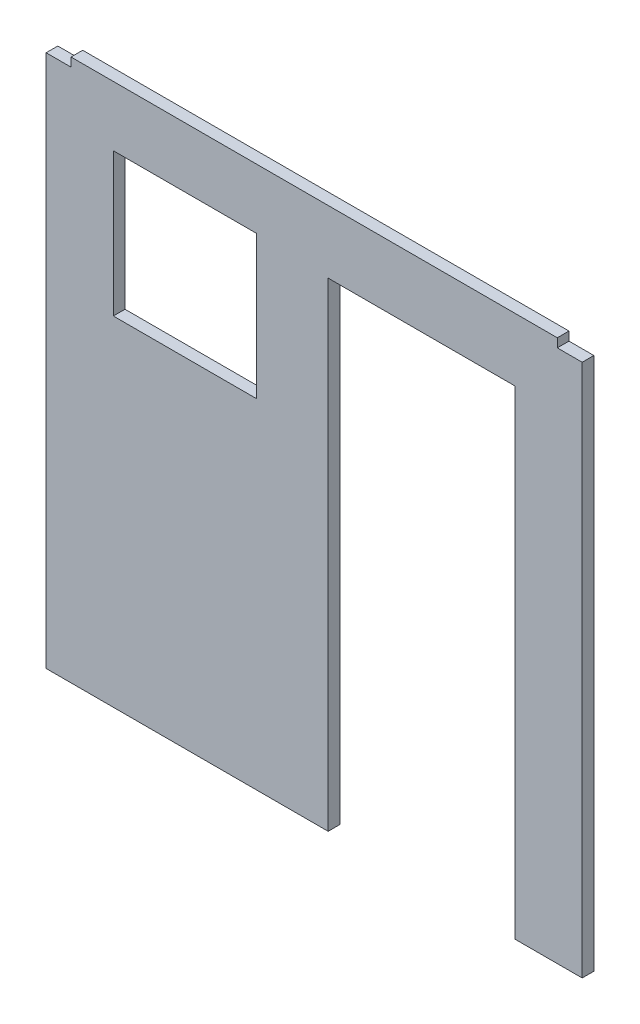
ISO-10303-21;
HEADER;
FILE_DESCRIPTION(('STEP AP214'),'2;1');
FILE_NAME('part.step','',(''),(''),'','','');
FILE_SCHEMA(('AUTOMOTIVE_DESIGN { 1 0 10303 214 1 1 1 1 }'));
ENDSEC;
DATA;
#1=APPLICATION_CONTEXT('core data for automotive mechanical design processes');
#2=APPLICATION_PROTOCOL_DEFINITION('international standard','automotive_design',2000,#1);
#3=PRODUCT_CONTEXT('',#1,'mechanical');
#4=PRODUCT('Part','Part','',(#3));
#5=PRODUCT_RELATED_PRODUCT_CATEGORY('part','',(#4));
#6=PRODUCT_DEFINITION_FORMATION('','',#4);
#7=PRODUCT_DEFINITION_CONTEXT('part definition',#1,'design');
#8=PRODUCT_DEFINITION('design','',#6,#7);
#9=PRODUCT_DEFINITION_SHAPE('','',#8);
#10=(LENGTH_UNIT() NAMED_UNIT(*) SI_UNIT(.MILLI.,.METRE.));
#11=(NAMED_UNIT(*) PLANE_ANGLE_UNIT() SI_UNIT($,.RADIAN.));
#12=(NAMED_UNIT(*) SI_UNIT($,.STERADIAN.) SOLID_ANGLE_UNIT());
#13=UNCERTAINTY_MEASURE_WITH_UNIT(LENGTH_MEASURE(1.E-05),#10,'distance_accuracy_value','');
#14=(GEOMETRIC_REPRESENTATION_CONTEXT(3) GLOBAL_UNCERTAINTY_ASSIGNED_CONTEXT((#13)) GLOBAL_UNIT_ASSIGNED_CONTEXT((#10,
#11,#12)) REPRESENTATION_CONTEXT('',''));
#15=CARTESIAN_POINT('',(0.,0.,0.));
#16=DIRECTION('',(0.,0.,1.));
#17=DIRECTION('',(1.,0.,0.));
#18=AXIS2_PLACEMENT_3D('',#15,#16,#17);
#19=CARTESIAN_POINT('',(0.,-1178.179,50.8));
#20=DIRECTION('',(0.,1.,0.));
#21=DIRECTION('',(0.,0.,1.));
#22=AXIS2_PLACEMENT_3D('',#19,#20,#21);
#23=PLANE('',#22);
#24=DIRECTION('',(1.,0.,0.));
#25=VECTOR('',#24,1.);
#26=CARTESIAN_POINT('',(0.,-1178.179,50.8));
#27=LINE('',#26,#25);
#28=CARTESIAN_POINT('',(873.633,-1178.179,50.8));
#29=VERTEX_POINT('',#28);
#30=CARTESIAN_POINT('',(1165.225,-1178.179,50.8));
#31=VERTEX_POINT('',#30);
#32=EDGE_CURVE('E222',#29,#31,#27,.T.);
#33=ORIENTED_EDGE('',*,*,#32,.F.);
#34=DIRECTION('',(0.,0.,1.));
#35=VECTOR('',#34,1.);
#36=CARTESIAN_POINT('',(873.633,-1178.179,-2235.777198202));
#37=LINE('',#36,#35);
#38=CARTESIAN_POINT('',(873.633,-1178.179,0.));
#39=VERTEX_POINT('',#38);
#40=EDGE_CURVE('E185',#39,#29,#37,.T.);
#41=ORIENTED_EDGE('',*,*,#40,.F.);
#42=DIRECTION('',(1.,0.,0.));
#43=VECTOR('',#42,1.);
#44=CARTESIAN_POINT('',(0.,-1178.179,0.));
#45=LINE('',#44,#43);
#46=CARTESIAN_POINT('',(1165.225,-1178.179,0.));
#47=VERTEX_POINT('',#46);
#48=EDGE_CURVE('E246',#39,#47,#45,.T.);
#49=ORIENTED_EDGE('',*,*,#48,.T.);
#50=DIRECTION('',(0.,0.,-1.));
#51=VECTOR('',#50,1.);
#52=CARTESIAN_POINT('',(1165.225,-1178.179,50.8));
#53=LINE('',#52,#51);
#54=EDGE_CURVE('E253',#31,#47,#53,.T.);
#55=ORIENTED_EDGE('',*,*,#54,.F.);
#56=EDGE_LOOP('',(#33,#41,#49,#55));
#57=FACE_BOUND('',#56,.T.);
#58=ADVANCED_FACE('F37',(#57),#23,.F.);
#59=CARTESIAN_POINT('',(0.,1140.079,50.8));
#60=DIRECTION('',(0.,1.,0.));
#61=DIRECTION('',(0.,0.,1.));
#62=AXIS2_PLACEMENT_3D('',#59,#60,#61);
#63=PLANE('',#62);
#64=DIRECTION('',(1.,0.,0.));
#65=VECTOR('',#64,1.);
#66=CARTESIAN_POINT('',(0.,1140.079,0.));
#67=LINE('',#66,#65);
#68=CARTESIAN_POINT('',(1057.021,1140.079,0.));
#69=VERTEX_POINT('',#68);
#70=CARTESIAN_POINT('',(1165.225,1140.079,0.));
#71=VERTEX_POINT('',#70);
#72=EDGE_CURVE('E179',#69,#71,#67,.T.);
#73=ORIENTED_EDGE('',*,*,#72,.F.);
#74=DIRECTION('',(0.,0.,-1.));
#75=VECTOR('',#74,1.);
#76=CARTESIAN_POINT('',(1057.021,1140.079,50.8));
#77=LINE('',#76,#75);
#78=CARTESIAN_POINT('',(1057.021,1140.079,50.8));
#79=VERTEX_POINT('',#78);
#80=EDGE_CURVE('E11',#79,#69,#77,.T.);
#81=ORIENTED_EDGE('',*,*,#80,.F.);
#82=DIRECTION('',(1.,0.,0.));
#83=VECTOR('',#82,1.);
#84=CARTESIAN_POINT('',(0.,1140.079,50.8));
#85=LINE('',#84,#83);
#86=CARTESIAN_POINT('',(1165.225,1140.079,50.8));
#87=VERTEX_POINT('',#86);
#88=EDGE_CURVE('E205',#79,#87,#85,.T.);
#89=ORIENTED_EDGE('',*,*,#88,.T.);
#90=DIRECTION('',(0.,0.,-1.));
#91=VECTOR('',#90,1.);
#92=CARTESIAN_POINT('',(1165.225,1140.079,50.8));
#93=LINE('',#92,#91);
#94=EDGE_CURVE('E229',#87,#71,#93,.T.);
#95=ORIENTED_EDGE('',*,*,#94,.T.);
#96=EDGE_LOOP('',(#73,#81,#89,#95));
#97=FACE_BOUND('',#96,.T.);
#98=ADVANCED_FACE('F39',(#97),#63,.T.);
#99=CARTESIAN_POINT('',(1057.021,0.,50.8));
#100=DIRECTION('',(1.,0.,0.));
#101=DIRECTION('',(0.,0.,-1.));
#102=AXIS2_PLACEMENT_3D('',#99,#100,#101);
#103=PLANE('',#102);
#104=DIRECTION('',(0.,-1.,0.));
#105=VECTOR('',#104,1.);
#106=CARTESIAN_POINT('',(1057.021,0.,0.));
#107=LINE('',#106,#105);
#108=CARTESIAN_POINT('',(1057.021,1178.179,0.));
#109=VERTEX_POINT('',#108);
#110=EDGE_CURVE('E232',#109,#69,#107,.T.);
#111=ORIENTED_EDGE('',*,*,#110,.F.);
#112=DIRECTION('',(0.,0.,-1.));
#113=VECTOR('',#112,1.);
#114=CARTESIAN_POINT('',(1057.021,1178.179,50.8));
#115=LINE('',#114,#113);
#116=CARTESIAN_POINT('',(1057.021,1178.179,50.8));
#117=VERTEX_POINT('',#116);
#118=EDGE_CURVE('E45',#117,#109,#115,.T.);
#119=ORIENTED_EDGE('',*,*,#118,.F.);
#120=DIRECTION('',(0.,-1.,0.));
#121=VECTOR('',#120,1.);
#122=CARTESIAN_POINT('',(1057.021,0.,50.8));
#123=LINE('',#122,#121);
#124=EDGE_CURVE('E208',#117,#79,#123,.T.);
#125=ORIENTED_EDGE('',*,*,#124,.T.);
#126=ORIENTED_EDGE('',*,*,#80,.T.);
#127=EDGE_LOOP('',(#111,#119,#125,#126));
#128=FACE_BOUND('',#127,.T.);
#129=ADVANCED_FACE('F271',(#128),#103,.T.);
#130=CARTESIAN_POINT('',(0.,1178.179,50.8));
#131=DIRECTION('',(0.,1.,0.));
#132=DIRECTION('',(0.,0.,1.));
#133=AXIS2_PLACEMENT_3D('',#130,#131,#132);
#134=PLANE('',#133);
#135=DIRECTION('',(1.,0.,0.));
#136=VECTOR('',#135,1.);
#137=CARTESIAN_POINT('',(0.,1178.179,0.));
#138=LINE('',#137,#136);
#139=CARTESIAN_POINT('',(-1057.021,1178.179,0.));
#140=VERTEX_POINT('',#139);
#141=EDGE_CURVE('E235',#140,#109,#138,.T.);
#142=ORIENTED_EDGE('',*,*,#141,.F.);
#143=DIRECTION('',(0.,0.,-1.));
#144=VECTOR('',#143,1.);
#145=CARTESIAN_POINT('',(-1057.021,1178.179,50.8));
#146=LINE('',#145,#144);
#147=CARTESIAN_POINT('',(-1057.021,1178.179,50.8));
#148=VERTEX_POINT('',#147);
#149=EDGE_CURVE('E263',#148,#140,#146,.T.);
#150=ORIENTED_EDGE('',*,*,#149,.F.);
#151=DIRECTION('',(1.,0.,0.));
#152=VECTOR('',#151,1.);
#153=CARTESIAN_POINT('',(0.,1178.179,50.8));
#154=LINE('',#153,#152);
#155=EDGE_CURVE('E212',#148,#117,#154,.T.);
#156=ORIENTED_EDGE('',*,*,#155,.T.);
#157=ORIENTED_EDGE('',*,*,#118,.T.);
#158=EDGE_LOOP('',(#142,#150,#156,#157));
#159=FACE_BOUND('',#158,.T.);
#160=ADVANCED_FACE('F267',(#159),#134,.T.);
#161=CARTESIAN_POINT('',(-1057.021,0.,50.8));
#162=DIRECTION('',(1.,0.,0.));
#163=DIRECTION('',(0.,0.,-1.));
#164=AXIS2_PLACEMENT_3D('',#161,#162,#163);
#165=PLANE('',#164);
#166=DIRECTION('',(0.,-1.,0.));
#167=VECTOR('',#166,1.);
#168=CARTESIAN_POINT('',(-1057.021,0.,0.));
#169=LINE('',#168,#167);
#170=CARTESIAN_POINT('',(-1057.021,1140.079,0.));
#171=VERTEX_POINT('',#170);
#172=EDGE_CURVE('E238',#140,#171,#169,.T.);
#173=ORIENTED_EDGE('',*,*,#172,.T.);
#174=DIRECTION('',(0.,0.,-1.));
#175=VECTOR('',#174,1.);
#176=CARTESIAN_POINT('',(-1057.021,1140.079,50.8));
#177=LINE('',#176,#175);
#178=CARTESIAN_POINT('',(-1057.021,1140.079,50.8));
#179=VERTEX_POINT('',#178);
#180=EDGE_CURVE('E261',#179,#171,#177,.T.);
#181=ORIENTED_EDGE('',*,*,#180,.F.);
#182=DIRECTION('',(0.,-1.,0.));
#183=VECTOR('',#182,1.);
#184=CARTESIAN_POINT('',(-1057.021,0.,50.8));
#185=LINE('',#184,#183);
#186=EDGE_CURVE('E215',#148,#179,#185,.T.);
#187=ORIENTED_EDGE('',*,*,#186,.F.);
#188=ORIENTED_EDGE('',*,*,#149,.T.);
#189=EDGE_LOOP('',(#173,#181,#187,#188));
#190=FACE_BOUND('',#189,.T.);
#191=ADVANCED_FACE('F281',(#190),#165,.F.);
#192=CARTESIAN_POINT('',(0.,1140.079,50.8));
#193=DIRECTION('',(0.,1.,0.));
#194=DIRECTION('',(0.,0.,1.));
#195=AXIS2_PLACEMENT_3D('',#192,#193,#194);
#196=PLANE('',#195);
#197=DIRECTION('',(1.,0.,0.));
#198=VECTOR('',#197,1.);
#199=CARTESIAN_POINT('',(0.,1140.079,0.));
#200=LINE('',#199,#198);
#201=CARTESIAN_POINT('',(-1165.225,1140.079,0.));
#202=VERTEX_POINT('',#201);
#203=EDGE_CURVE('E241',#202,#171,#200,.T.);
#204=ORIENTED_EDGE('',*,*,#203,.F.);
#205=DIRECTION('',(0.,0.,-1.));
#206=VECTOR('',#205,1.);
#207=CARTESIAN_POINT('',(-1165.225,1140.079,50.8));
#208=LINE('',#207,#206);
#209=CARTESIAN_POINT('',(-1165.225,1140.079,50.8));
#210=VERTEX_POINT('',#209);
#211=EDGE_CURVE('E259',#210,#202,#208,.T.);
#212=ORIENTED_EDGE('',*,*,#211,.F.);
#213=DIRECTION('',(1.,0.,0.));
#214=VECTOR('',#213,1.);
#215=CARTESIAN_POINT('',(0.,1140.079,50.8));
#216=LINE('',#215,#214);
#217=EDGE_CURVE('E217',#210,#179,#216,.T.);
#218=ORIENTED_EDGE('',*,*,#217,.T.);
#219=ORIENTED_EDGE('',*,*,#180,.T.);
#220=EDGE_LOOP('',(#204,#212,#218,#219));
#221=FACE_BOUND('',#220,.T.);
#222=ADVANCED_FACE('F316',(#221),#196,.T.);
#223=CARTESIAN_POINT('',(-1165.225,-2.1960323921388E-13,50.8));
#224=DIRECTION('',(1.,0.,0.));
#225=DIRECTION('',(0.,1.,0.));
#226=AXIS2_PLACEMENT_3D('',#223,#224,#225);
#227=PLANE('',#226);
#228=DIRECTION('',(0.,-1.,0.));
#229=VECTOR('',#228,1.);
#230=CARTESIAN_POINT('',(-1165.225,-2.1960323921388E-13,0.));
#231=LINE('',#230,#229);
#232=CARTESIAN_POINT('',(-1165.225,-1178.179,0.));
#233=VERTEX_POINT('',#232);
#234=EDGE_CURVE('E244',#202,#233,#231,.T.);
#235=ORIENTED_EDGE('',*,*,#234,.T.);
#236=DIRECTION('',(0.,0.,-1.));
#237=VECTOR('',#236,1.);
#238=CARTESIAN_POINT('',(-1165.225,-1178.179,50.8));
#239=LINE('',#238,#237);
#240=CARTESIAN_POINT('',(-1165.225,-1178.179,50.8));
#241=VERTEX_POINT('',#240);
#242=EDGE_CURVE('E256',#241,#233,#239,.T.);
#243=ORIENTED_EDGE('',*,*,#242,.F.);
#244=DIRECTION('',(0.,-1.,0.));
#245=VECTOR('',#244,1.);
#246=CARTESIAN_POINT('',(-1165.225,-2.1960323921388E-13,50.8));
#247=LINE('',#246,#245);
#248=EDGE_CURVE('E220',#210,#241,#247,.T.);
#249=ORIENTED_EDGE('',*,*,#248,.F.);
#250=ORIENTED_EDGE('',*,*,#211,.T.);
#251=EDGE_LOOP('',(#235,#243,#249,#250));
#252=FACE_BOUND('',#251,.T.);
#253=ADVANCED_FACE('F314',(#252),#227,.F.);
#254=CARTESIAN_POINT('',(60.8329999999997,-1178.179,0.));
#255=VERTEX_POINT('',#254);
#256=EDGE_CURVE('E247',#233,#255,#45,.T.);
#257=ORIENTED_EDGE('',*,*,#256,.T.);
#258=DIRECTION('',(0.,0.,1.));
#259=VECTOR('',#258,1.);
#260=CARTESIAN_POINT('',(60.8329999999997,-1178.179,-2235.777198202));
#261=LINE('',#260,#259);
#262=CARTESIAN_POINT('',(60.8329999999997,-1178.179,50.8));
#263=VERTEX_POINT('',#262);
#264=EDGE_CURVE('E198',#255,#263,#261,.T.);
#265=ORIENTED_EDGE('',*,*,#264,.T.);
#266=EDGE_CURVE('E223',#241,#263,#27,.T.);
#267=ORIENTED_EDGE('',*,*,#266,.F.);
#268=ORIENTED_EDGE('',*,*,#242,.T.);
#269=EDGE_LOOP('',(#257,#265,#267,#268));
#270=FACE_BOUND('',#269,.T.);
#271=ADVANCED_FACE('F309',(#270),#23,.F.);
#272=CARTESIAN_POINT('',(1165.225,2.1960323921388E-13,50.8));
#273=DIRECTION('',(1.,0.,0.));
#274=DIRECTION('',(0.,1.,0.));
#275=AXIS2_PLACEMENT_3D('',#272,#273,#274);
#276=PLANE('',#275);
#277=DIRECTION('',(0.,-1.,0.));
#278=VECTOR('',#277,1.);
#279=CARTESIAN_POINT('',(1165.225,2.1960323921388E-13,0.));
#280=LINE('',#279,#278);
#281=EDGE_CURVE('E209',#71,#47,#280,.T.);
#282=ORIENTED_EDGE('',*,*,#281,.F.);
#283=ORIENTED_EDGE('',*,*,#94,.F.);
#284=DIRECTION('',(0.,-1.,0.));
#285=VECTOR('',#284,1.);
#286=CARTESIAN_POINT('',(1165.225,2.1960323921388E-13,50.8));
#287=LINE('',#286,#285);
#288=EDGE_CURVE('E226',#87,#31,#287,.T.);
#289=ORIENTED_EDGE('',*,*,#288,.T.);
#290=ORIENTED_EDGE('',*,*,#54,.T.);
#291=EDGE_LOOP('',(#282,#283,#289,#290));
#292=FACE_BOUND('',#291,.T.);
#293=ADVANCED_FACE('F290',(#292),#276,.T.);
#294=CARTESIAN_POINT('',(0.,0.,50.8));
#295=DIRECTION('',(0.,0.,1.));
#296=DIRECTION('',(1.,0.,0.));
#297=AXIS2_PLACEMENT_3D('',#294,#295,#296);
#298=PLANE('',#297);
#299=DIRECTION('',(0.,1.,0.));
#300=VECTOR('',#299,1.);
#301=CARTESIAN_POINT('',(-250.825,917.321000000001,50.8));
#302=LINE('',#301,#300);
#303=CARTESIAN_POINT('',(-250.825,295.021000000001,50.8));
#304=VERTEX_POINT('',#303);
#305=CARTESIAN_POINT('',(-250.825,917.321000000001,50.8));
#306=VERTEX_POINT('',#305);
#307=EDGE_CURVE('E52',#304,#306,#302,.T.);
#308=ORIENTED_EDGE('',*,*,#307,.F.);
#309=DIRECTION('',(1.,0.,0.));
#310=VECTOR('',#309,1.);
#311=CARTESIAN_POINT('',(-873.125,295.021000000001,50.8));
#312=LINE('',#311,#310);
#313=CARTESIAN_POINT('',(-873.125,295.021000000001,50.8));
#314=VERTEX_POINT('',#313);
#315=EDGE_CURVE('E168',#314,#304,#312,.T.);
#316=ORIENTED_EDGE('',*,*,#315,.F.);
#317=DIRECTION('',(0.,-1.,0.));
#318=VECTOR('',#317,1.);
#319=CARTESIAN_POINT('',(-873.125,917.321000000001,50.8));
#320=LINE('',#319,#318);
#321=CARTESIAN_POINT('',(-873.125,917.321000000001,50.8));
#322=VERTEX_POINT('',#321);
#323=EDGE_CURVE('E152',#322,#314,#320,.T.);
#324=ORIENTED_EDGE('',*,*,#323,.F.);
#325=DIRECTION('',(-1.,0.,0.));
#326=VECTOR('',#325,1.);
#327=CARTESIAN_POINT('',(-873.125,917.321000000001,50.8));
#328=LINE('',#327,#326);
#329=EDGE_CURVE('E161',#306,#322,#328,.T.);
#330=ORIENTED_EDGE('',*,*,#329,.F.);
#331=EDGE_LOOP('',(#308,#316,#324,#330));
#332=FACE_BOUND('',#331,.T.);
#333=DIRECTION('',(0.,1.,0.));
#334=VECTOR('',#333,1.);
#335=CARTESIAN_POINT('',(873.632999999999,904.621,50.8));
#336=LINE('',#335,#334);
#337=CARTESIAN_POINT('',(873.632999999999,904.621,50.8));
#338=VERTEX_POINT('',#337);
#339=EDGE_CURVE('E188',#29,#338,#336,.T.);
#340=ORIENTED_EDGE('',*,*,#339,.F.);
#341=ORIENTED_EDGE('',*,*,#32,.T.);
#342=ORIENTED_EDGE('',*,*,#288,.F.);
#343=ORIENTED_EDGE('',*,*,#88,.F.);
#344=ORIENTED_EDGE('',*,*,#124,.F.);
#345=ORIENTED_EDGE('',*,*,#155,.F.);
#346=ORIENTED_EDGE('',*,*,#186,.T.);
#347=ORIENTED_EDGE('',*,*,#217,.F.);
#348=ORIENTED_EDGE('',*,*,#248,.T.);
#349=ORIENTED_EDGE('',*,*,#266,.T.);
#350=DIRECTION('',(0.,-1.,0.));
#351=VECTOR('',#350,1.);
#352=CARTESIAN_POINT('',(60.8329999999995,904.621,50.8));
#353=LINE('',#352,#351);
#354=CARTESIAN_POINT('',(60.8329999999995,904.621,50.8));
#355=VERTEX_POINT('',#354);
#356=EDGE_CURVE('E194',#355,#263,#353,.T.);
#357=ORIENTED_EDGE('',*,*,#356,.F.);
#358=DIRECTION('',(-1.,0.,0.));
#359=VECTOR('',#358,1.);
#360=CARTESIAN_POINT('',(60.8329999999995,904.621,50.8));
#361=LINE('',#360,#359);
#362=EDGE_CURVE('E191',#338,#355,#361,.T.);
#363=ORIENTED_EDGE('',*,*,#362,.F.);
#364=EDGE_LOOP('',(#340,#341,#342,#343,#344,#345,#346,#347,#348,#349,#357,#363));
#365=FACE_BOUND('',#364,.T.);
#366=ADVANCED_FACE('F165',(#332,#365),#298,.T.);
#367=CARTESIAN_POINT('',(0.,0.,0.));
#368=DIRECTION('',(0.,0.,1.));
#369=DIRECTION('',(1.,0.,0.));
#370=AXIS2_PLACEMENT_3D('',#367,#368,#369);
#371=PLANE('',#370);
#372=DIRECTION('',(-1.,0.,0.));
#373=VECTOR('',#372,1.);
#374=CARTESIAN_POINT('',(-873.125,295.021000000001,0.));
#375=LINE('',#374,#373);
#376=CARTESIAN_POINT('',(-250.825,295.021000000001,0.));
#377=VERTEX_POINT('',#376);
#378=CARTESIAN_POINT('',(-873.125,295.021000000001,0.));
#379=VERTEX_POINT('',#378);
#380=EDGE_CURVE('E363',#377,#379,#375,.T.);
#381=ORIENTED_EDGE('',*,*,#380,.F.);
#382=DIRECTION('',(0.,-1.,0.));
#383=VECTOR('',#382,1.);
#384=CARTESIAN_POINT('',(-250.825,917.321000000001,0.));
#385=LINE('',#384,#383);
#386=CARTESIAN_POINT('',(-250.825000000001,917.321000000001,0.));
#387=VERTEX_POINT('',#386);
#388=EDGE_CURVE('E180',#387,#377,#385,.T.);
#389=ORIENTED_EDGE('',*,*,#388,.F.);
#390=DIRECTION('',(1.,0.,0.));
#391=VECTOR('',#390,1.);
#392=CARTESIAN_POINT('',(-873.125,917.321000000001,0.));
#393=LINE('',#392,#391);
#394=CARTESIAN_POINT('',(-873.125,917.321000000001,0.));
#395=VERTEX_POINT('',#394);
#396=EDGE_CURVE('E177',#395,#387,#393,.T.);
#397=ORIENTED_EDGE('',*,*,#396,.F.);
#398=DIRECTION('',(0.,1.,0.));
#399=VECTOR('',#398,1.);
#400=CARTESIAN_POINT('',(-873.125,917.321000000001,0.));
#401=LINE('',#400,#399);
#402=EDGE_CURVE('E155',#379,#395,#401,.T.);
#403=ORIENTED_EDGE('',*,*,#402,.F.);
#404=EDGE_LOOP('',(#381,#389,#397,#403));
#405=FACE_BOUND('',#404,.T.);
#406=ORIENTED_EDGE('',*,*,#48,.F.);
#407=DIRECTION('',(0.,-1.,0.));
#408=VECTOR('',#407,1.);
#409=CARTESIAN_POINT('',(873.632999999999,904.621,0.));
#410=LINE('',#409,#408);
#411=CARTESIAN_POINT('',(873.632999999999,904.621,0.));
#412=VERTEX_POINT('',#411);
#413=EDGE_CURVE('E184',#412,#39,#410,.T.);
#414=ORIENTED_EDGE('',*,*,#413,.F.);
#415=DIRECTION('',(1.,0.,0.));
#416=VECTOR('',#415,1.);
#417=CARTESIAN_POINT('',(60.8329999999995,904.621,0.));
#418=LINE('',#417,#416);
#419=CARTESIAN_POINT('',(60.8329999999995,904.621,0.));
#420=VERTEX_POINT('',#419);
#421=EDGE_CURVE('E187',#420,#412,#418,.T.);
#422=ORIENTED_EDGE('',*,*,#421,.F.);
#423=DIRECTION('',(0.,1.,0.));
#424=VECTOR('',#423,1.);
#425=CARTESIAN_POINT('',(60.8329999999995,904.621,0.));
#426=LINE('',#425,#424);
#427=EDGE_CURVE('E181',#255,#420,#426,.T.);
#428=ORIENTED_EDGE('',*,*,#427,.F.);
#429=ORIENTED_EDGE('',*,*,#256,.F.);
#430=ORIENTED_EDGE('',*,*,#234,.F.);
#431=ORIENTED_EDGE('',*,*,#203,.T.);
#432=ORIENTED_EDGE('',*,*,#172,.F.);
#433=ORIENTED_EDGE('',*,*,#141,.T.);
#434=ORIENTED_EDGE('',*,*,#110,.T.);
#435=ORIENTED_EDGE('',*,*,#72,.T.);
#436=ORIENTED_EDGE('',*,*,#281,.T.);
#437=EDGE_LOOP('',(#406,#414,#422,#428,#429,#430,#431,#432,#433,#434,#435,#436));
#438=FACE_BOUND('',#437,.T.);
#439=ADVANCED_FACE('F276',(#405,#438),#371,.F.);
#440=CARTESIAN_POINT('',(873.632999999999,904.621,-2235.777198202));
#441=DIRECTION('',(1.,0.,0.));
#442=DIRECTION('',(0.,1.,0.));
#443=AXIS2_PLACEMENT_3D('',#440,#441,#442);
#444=PLANE('',#443);
#445=ORIENTED_EDGE('',*,*,#413,.T.);
#446=ORIENTED_EDGE('',*,*,#40,.T.);
#447=ORIENTED_EDGE('',*,*,#339,.T.);
#448=DIRECTION('',(0.,0.,1.));
#449=VECTOR('',#448,1.);
#450=CARTESIAN_POINT('',(873.632999999999,904.621,-2235.777198202));
#451=LINE('',#450,#449);
#452=EDGE_CURVE('E196',#412,#338,#451,.T.);
#453=ORIENTED_EDGE('',*,*,#452,.F.);
#454=EDGE_LOOP('',(#445,#446,#447,#453));
#455=FACE_BOUND('',#454,.T.);
#456=ADVANCED_FACE('F300',(#455),#444,.F.);
#457=CARTESIAN_POINT('',(60.8329999999995,904.621,-2235.777198202));
#458=DIRECTION('',(-1.,0.,0.));
#459=DIRECTION('',(0.,-1.,0.));
#460=AXIS2_PLACEMENT_3D('',#457,#458,#459);
#461=PLANE('',#460);
#462=ORIENTED_EDGE('',*,*,#427,.T.);
#463=DIRECTION('',(0.,0.,1.));
#464=VECTOR('',#463,1.);
#465=CARTESIAN_POINT('',(60.8329999999995,904.621,-2235.777198202));
#466=LINE('',#465,#464);
#467=EDGE_CURVE('E201',#420,#355,#466,.T.);
#468=ORIENTED_EDGE('',*,*,#467,.T.);
#469=ORIENTED_EDGE('',*,*,#356,.T.);
#470=ORIENTED_EDGE('',*,*,#264,.F.);
#471=EDGE_LOOP('',(#462,#468,#469,#470));
#472=FACE_BOUND('',#471,.T.);
#473=ADVANCED_FACE('F306',(#472),#461,.F.);
#474=CARTESIAN_POINT('',(60.8329999999995,904.621,-2235.777198202));
#475=DIRECTION('',(0.,1.,0.));
#476=DIRECTION('',(0.,0.,1.));
#477=AXIS2_PLACEMENT_3D('',#474,#475,#476);
#478=PLANE('',#477);
#479=ORIENTED_EDGE('',*,*,#421,.T.);
#480=ORIENTED_EDGE('',*,*,#452,.T.);
#481=ORIENTED_EDGE('',*,*,#362,.T.);
#482=ORIENTED_EDGE('',*,*,#467,.F.);
#483=EDGE_LOOP('',(#479,#480,#481,#482));
#484=FACE_BOUND('',#483,.T.);
#485=ADVANCED_FACE('F303',(#484),#478,.F.);
#486=CARTESIAN_POINT('',(-250.825,917.321000000001,-2235.777198202));
#487=DIRECTION('',(1.,0.,0.));
#488=DIRECTION('',(0.,1.,0.));
#489=AXIS2_PLACEMENT_3D('',#486,#487,#488);
#490=PLANE('',#489);
#491=ORIENTED_EDGE('',*,*,#388,.T.);
#492=DIRECTION('',(0.,0.,1.));
#493=VECTOR('',#492,1.);
#494=CARTESIAN_POINT('',(-250.825,295.021000000001,-2235.777198202));
#495=LINE('',#494,#493);
#496=EDGE_CURVE('E173',#377,#304,#495,.T.);
#497=ORIENTED_EDGE('',*,*,#496,.T.);
#498=ORIENTED_EDGE('',*,*,#307,.T.);
#499=DIRECTION('',(0.,0.,1.));
#500=VECTOR('',#499,1.);
#501=CARTESIAN_POINT('',(-250.825,917.321000000001,-2235.777198202));
#502=LINE('',#501,#500);
#503=EDGE_CURVE('E158',#387,#306,#502,.T.);
#504=ORIENTED_EDGE('',*,*,#503,.F.);
#505=EDGE_LOOP('',(#491,#497,#498,#504));
#506=FACE_BOUND('',#505,.T.);
#507=ADVANCED_FACE('F347',(#506),#490,.F.);
#508=CARTESIAN_POINT('',(-873.125,295.021000000001,-2235.777198202));
#509=DIRECTION('',(0.,-1.,0.));
#510=DIRECTION('',(0.,0.,-1.));
#511=AXIS2_PLACEMENT_3D('',#508,#509,#510);
#512=PLANE('',#511);
#513=ORIENTED_EDGE('',*,*,#380,.T.);
#514=DIRECTION('',(0.,0.,1.));
#515=VECTOR('',#514,1.);
#516=CARTESIAN_POINT('',(-873.125,295.021000000001,-2235.777198202));
#517=LINE('',#516,#515);
#518=EDGE_CURVE('E157',#379,#314,#517,.T.);
#519=ORIENTED_EDGE('',*,*,#518,.T.);
#520=ORIENTED_EDGE('',*,*,#315,.T.);
#521=ORIENTED_EDGE('',*,*,#496,.F.);
#522=EDGE_LOOP('',(#513,#519,#520,#521));
#523=FACE_BOUND('',#522,.T.);
#524=ADVANCED_FACE('F352',(#523),#512,.F.);
#525=CARTESIAN_POINT('',(-873.125,917.321000000001,-2235.777198202));
#526=DIRECTION('',(-1.,0.,0.));
#527=DIRECTION('',(0.,0.,1.));
#528=AXIS2_PLACEMENT_3D('',#525,#526,#527);
#529=PLANE('',#528);
#530=ORIENTED_EDGE('',*,*,#402,.T.);
#531=DIRECTION('',(0.,0.,1.));
#532=VECTOR('',#531,1.);
#533=CARTESIAN_POINT('',(-873.125,917.321000000001,-2235.777198202));
#534=LINE('',#533,#532);
#535=EDGE_CURVE('E60',#395,#322,#534,.T.);
#536=ORIENTED_EDGE('',*,*,#535,.T.);
#537=ORIENTED_EDGE('',*,*,#323,.T.);
#538=ORIENTED_EDGE('',*,*,#518,.F.);
#539=EDGE_LOOP('',(#530,#536,#537,#538));
#540=FACE_BOUND('',#539,.T.);
#541=ADVANCED_FACE('F149',(#540),#529,.F.);
#542=CARTESIAN_POINT('',(-873.125,917.321000000001,-2235.777198202));
#543=DIRECTION('',(0.,1.,0.));
#544=DIRECTION('',(-1.,0.,0.));
#545=AXIS2_PLACEMENT_3D('',#542,#543,#544);
#546=PLANE('',#545);
#547=ORIENTED_EDGE('',*,*,#396,.T.);
#548=ORIENTED_EDGE('',*,*,#503,.T.);
#549=ORIENTED_EDGE('',*,*,#329,.T.);
#550=ORIENTED_EDGE('',*,*,#535,.F.);
#551=EDGE_LOOP('',(#547,#548,#549,#550));
#552=FACE_BOUND('',#551,.T.);
#553=ADVANCED_FACE('F162',(#552),#546,.F.);
#554=CLOSED_SHELL('',(#58,#98,#129,#160,#191,#222,#253,#271,#293,#366,#439,#456,#473,#485,#507,
#524,#541,#553));
#555=MANIFOLD_SOLID_BREP('B2',#554);
#556=ADVANCED_BREP_SHAPE_REPRESENTATION('',(#18,#555),#14);
#557=SHAPE_DEFINITION_REPRESENTATION(#9,#556);
ENDSEC;
END-ISO-10303-21;
